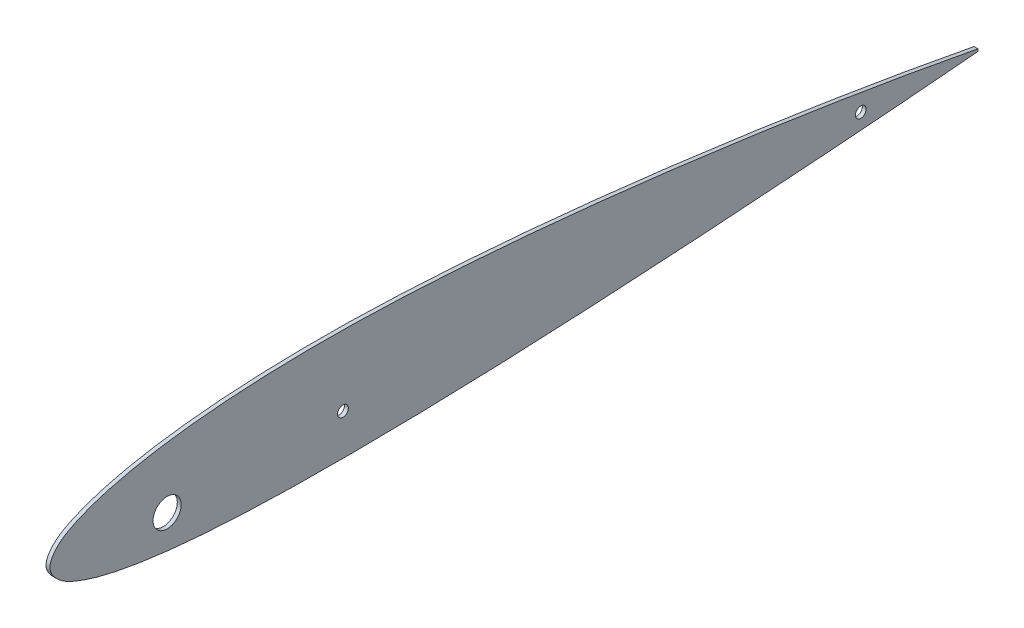
ISO-10303-21;
HEADER;
FILE_DESCRIPTION(('STEP AP214'),'2;1');
FILE_NAME('part.step','',(''),(''),'','','');
FILE_SCHEMA(('AUTOMOTIVE_DESIGN { 1 0 10303 214 1 1 1 1 }'));
ENDSEC;
DATA;
#1=APPLICATION_CONTEXT('core data for automotive mechanical design processes');
#2=APPLICATION_PROTOCOL_DEFINITION('international standard','automotive_design',2000,#1);
#3=PRODUCT_CONTEXT('',#1,'mechanical');
#4=PRODUCT('Part','Part','',(#3));
#5=PRODUCT_RELATED_PRODUCT_CATEGORY('part','',(#4));
#6=PRODUCT_DEFINITION_FORMATION('','',#4);
#7=PRODUCT_DEFINITION_CONTEXT('part definition',#1,'design');
#8=PRODUCT_DEFINITION('design','',#6,#7);
#9=PRODUCT_DEFINITION_SHAPE('','',#8);
#10=(LENGTH_UNIT() NAMED_UNIT(*) SI_UNIT(.MILLI.,.METRE.));
#11=(NAMED_UNIT(*) PLANE_ANGLE_UNIT() SI_UNIT($,.RADIAN.));
#12=(NAMED_UNIT(*) SI_UNIT($,.STERADIAN.) SOLID_ANGLE_UNIT());
#13=UNCERTAINTY_MEASURE_WITH_UNIT(LENGTH_MEASURE(1.E-05),#10,'distance_accuracy_value','');
#14=(GEOMETRIC_REPRESENTATION_CONTEXT(3) GLOBAL_UNCERTAINTY_ASSIGNED_CONTEXT((#13)) GLOBAL_UNIT_ASSIGNED_CONTEXT((#10,
#11,#12)) REPRESENTATION_CONTEXT('',''));
#15=CARTESIAN_POINT('',(0.,0.,0.));
#16=DIRECTION('',(0.,0.,1.));
#17=DIRECTION('',(1.,0.,0.));
#18=AXIS2_PLACEMENT_3D('',#15,#16,#17);
#19=CARTESIAN_POINT('',(2.,0.598497198061794,-475.010074802855));
#20=CARTESIAN_POINT('',(2.,2.0790236287189,-467.158690520784));
#21=CARTESIAN_POINT('',(2.,5.04046520752321,-451.453860547719));
#22=CARTESIAN_POINT('',(2.,10.5303729676981,-419.979582043477));
#23=CARTESIAN_POINT('',(2.,16.8373236789927,-380.568519358802));
#24=CARTESIAN_POINT('',(2.,23.5016640304857,-333.177066429499));
#25=CARTESIAN_POINT('',(2.,29.2721627629077,-285.712995661429));
#26=CARTESIAN_POINT('',(2.,33.9707482150302,-238.176447157113));
#27=CARTESIAN_POINT('',(2.,37.4185172913638,-190.512569895496));
#28=CARTESIAN_POINT('',(2.,38.771778218813,-150.679357097197));
#29=CARTESIAN_POINT('',(2.,38.4312492810106,-118.758979212691));
#30=CARTESIAN_POINT('',(2.,37.3917675533514,-94.8132002730884));
#31=CARTESIAN_POINT('',(2.,35.2890977949255,-70.8709465141157));
#32=CARTESIAN_POINT('',(2.,32.4441637644638,-50.9619868844845));
#33=CARTESIAN_POINT('',(2.,29.0608425273149,-35.093906393071));
#34=CARTESIAN_POINT('',(2.,25.7786131745384,-23.1483181376206));
#35=CARTESIAN_POINT('',(2.,21.7884828092321,-13.1031754093609));
#36=CARTESIAN_POINT('',(2.,17.0044592579488,-4.48816979284215));
#37=CARTESIAN_POINT('',(2.,7.90094705341297,2.91234120427389));
#38=CARTESIAN_POINT('',(2.,-0.676100888636408,-5.05216124977651));
#39=CARTESIAN_POINT('',(2.,-4.94658367346644,-13.8832659371882));
#40=CARTESIAN_POINT('',(2.,-8.35498448423368,-24.0571931578956));
#41=CARTESIAN_POINT('',(2.,-11.0298527935371,-36.04230965412));
#42=CARTESIAN_POINT('',(2.,-13.6976980033518,-51.8649255104538));
#43=CARTESIAN_POINT('',(2.,-15.8676272838065,-71.6006452179179));
#44=CARTESIAN_POINT('',(2.,-17.4191085566015,-95.2553331511756));
#45=CARTESIAN_POINT('',(2.,-18.2335362886324,-118.863099098869));
#46=CARTESIAN_POINT('',(2.,-18.6213010186528,-150.313877095147));
#47=CARTESIAN_POINT('',(2.,-18.1807835065514,-189.707327800163));
#48=CARTESIAN_POINT('',(2.,-16.6534864273974,-237.048964840664));
#49=CARTESIAN_POINT('',(2.,-14.3400470711003,-284.501569815214));
#50=CARTESIAN_POINT('',(2.,-11.493536730421,-332.013270591345));
#51=CARTESIAN_POINT('',(2.,-8.26585973787703,-379.598404528134));
#52=CARTESIAN_POINT('',(2.,-5.27824397196585,-419.295052652683));
#53=CARTESIAN_POINT('',(2.,-2.68922426390956,-451.101430605551));
#54=CARTESIAN_POINT('',(2.,-1.29597982699712,-467.020539675113));
#55=CARTESIAN_POINT('',(2.,-0.598497198061795,-474.989925197145));
#56=B_SPLINE_CURVE_WITH_KNOTS('',3,(#19,#20,#21,#22,#23,#24,#25,#26,#27,#28,#29,#30,#31,#32,#33,
#34,#35,#36,#37,#38,#39,#40,#41,#42,#43,#44,#45,#46,#47,#48,#49,#50,#51,#52,#53,#54,#55),
.UNSPECIFIED.,.F.,.F.,(4,1,1,1,1,1,1,1,1,1,1,1,1,1,1,1,1,1,1,1,1,1,1,1,1,1,1,1,1,1,1,1,1,1,4),
(0.,0.0247583527022921,0.0495232057983208,0.099002464419805,0.148431640988793,0.197816092678823,
0.247156978041538,0.296440500967814,0.345884085447012,0.370605915917013,0.395346156344423,
0.420138805885135,0.4450560288657,0.457622030352105,0.470360866612067,0.483523326653886,
0.490626325383128,0.501772115898221,0.512907946738326,0.519977099804335,0.533052484339323,
0.545674076898575,0.558115541146016,0.58272509680566,0.607174358189599,0.631557278595084,
0.65591625667648,0.704636043070596,0.753621853029336,0.80268738739157,0.851851697592658,
0.901113053173649,0.950481472331415,0.975210155559022,1.),.UNSPECIFIED.);
#57=DIRECTION('',(-1.,0.,0.));
#58=VECTOR('',#57,1.);
#59=SURFACE_OF_LINEAR_EXTRUSION('',#56,#58);
#60=CARTESIAN_POINT('',(0.,0.598497198061794,-475.010074802855));
#61=CARTESIAN_POINT('',(0.,2.0790236287189,-467.158690520784));
#62=CARTESIAN_POINT('',(0.,5.04046520752321,-451.453860547719));
#63=CARTESIAN_POINT('',(0.,10.5303729676981,-419.979582043477));
#64=CARTESIAN_POINT('',(0.,16.8373236789927,-380.568519358802));
#65=CARTESIAN_POINT('',(0.,23.5016640304857,-333.177066429499));
#66=CARTESIAN_POINT('',(0.,29.2721627629077,-285.712995661429));
#67=CARTESIAN_POINT('',(0.,33.9707482150302,-238.176447157113));
#68=CARTESIAN_POINT('',(0.,37.4185172913638,-190.512569895496));
#69=CARTESIAN_POINT('',(0.,38.771778218813,-150.679357097197));
#70=CARTESIAN_POINT('',(0.,38.4312492810106,-118.758979212691));
#71=CARTESIAN_POINT('',(0.,37.3917675533514,-94.8132002730884));
#72=CARTESIAN_POINT('',(0.,35.2890977949255,-70.8709465141157));
#73=CARTESIAN_POINT('',(0.,32.4441637644638,-50.9619868844845));
#74=CARTESIAN_POINT('',(0.,29.0608425273149,-35.093906393071));
#75=CARTESIAN_POINT('',(0.,25.7786131745384,-23.1483181376206));
#76=CARTESIAN_POINT('',(0.,21.7884828092321,-13.1031754093609));
#77=CARTESIAN_POINT('',(0.,17.0044592579488,-4.48816979284215));
#78=CARTESIAN_POINT('',(0.,7.90094705341297,2.91234120427389));
#79=CARTESIAN_POINT('',(0.,-0.676100888636408,-5.05216124977651));
#80=CARTESIAN_POINT('',(0.,-4.94658367346644,-13.8832659371882));
#81=CARTESIAN_POINT('',(0.,-8.35498448423368,-24.0571931578956));
#82=CARTESIAN_POINT('',(0.,-11.0298527935371,-36.04230965412));
#83=CARTESIAN_POINT('',(0.,-13.6976980033518,-51.8649255104538));
#84=CARTESIAN_POINT('',(0.,-15.8676272838065,-71.6006452179179));
#85=CARTESIAN_POINT('',(0.,-17.4191085566015,-95.2553331511756));
#86=CARTESIAN_POINT('',(0.,-18.2335362886324,-118.863099098869));
#87=CARTESIAN_POINT('',(0.,-18.6213010186528,-150.313877095147));
#88=CARTESIAN_POINT('',(0.,-18.1807835065514,-189.707327800163));
#89=CARTESIAN_POINT('',(0.,-16.6534864273974,-237.048964840664));
#90=CARTESIAN_POINT('',(0.,-14.3400470711003,-284.501569815214));
#91=CARTESIAN_POINT('',(0.,-11.493536730421,-332.013270591345));
#92=CARTESIAN_POINT('',(0.,-8.26585973787703,-379.598404528134));
#93=CARTESIAN_POINT('',(0.,-5.27824397196585,-419.295052652683));
#94=CARTESIAN_POINT('',(0.,-2.68922426390956,-451.101430605551));
#95=CARTESIAN_POINT('',(0.,-1.29597982699712,-467.020539675113));
#96=CARTESIAN_POINT('',(0.,-0.598497198061795,-474.989925197145));
#97=B_SPLINE_CURVE_WITH_KNOTS('',3,(#60,#61,#62,#63,#64,#65,#66,#67,#68,#69,#70,#71,#72,#73,#74,
#75,#76,#77,#78,#79,#80,#81,#82,#83,#84,#85,#86,#87,#88,#89,#90,#91,#92,#93,#94,#95,#96),
.UNSPECIFIED.,.F.,.F.,(4,1,1,1,1,1,1,1,1,1,1,1,1,1,1,1,1,1,1,1,1,1,1,1,1,1,1,1,1,1,1,1,1,1,4),
(0.,0.0247583527022921,0.0495232057983208,0.099002464419805,0.148431640988793,0.197816092678823,
0.247156978041538,0.296440500967814,0.345884085447012,0.370605915917013,0.395346156344423,
0.420138805885135,0.4450560288657,0.457622030352105,0.470360866612067,0.483523326653886,
0.490626325383128,0.501772115898221,0.512907946738326,0.519977099804335,0.533052484339323,
0.545674076898575,0.558115541146016,0.58272509680566,0.607174358189599,0.631557278595084,
0.65591625667648,0.704636043070596,0.753621853029336,0.80268738739157,0.851851697592658,
0.901113053173649,0.950481472331415,0.975210155559022,1.),.UNSPECIFIED.);
#98=CARTESIAN_POINT('',(0.,0.598497198061795,-475.010074802855));
#99=VERTEX_POINT('',#98);
#100=CARTESIAN_POINT('',(0.,-0.598497198061795,-474.989925197145));
#101=VERTEX_POINT('',#100);
#102=EDGE_CURVE('E69',#99,#101,#97,.T.);
#103=ORIENTED_EDGE('',*,*,#102,.T.);
#104=DIRECTION('',(-1.,0.,0.));
#105=VECTOR('',#104,1.);
#106=CARTESIAN_POINT('',(2.,-0.598497198061795,-474.989925197145));
#107=LINE('',#106,#105);
#108=CARTESIAN_POINT('',(2.,-0.598497198061795,-474.989925197145));
#109=VERTEX_POINT('',#108);
#110=EDGE_CURVE('E11',#109,#101,#107,.T.);
#111=ORIENTED_EDGE('',*,*,#110,.F.);
#112=CARTESIAN_POINT('',(2.,0.598497198061795,-475.010074802855));
#113=VERTEX_POINT('',#112);
#114=EDGE_CURVE('E68',#113,#109,#56,.T.);
#115=ORIENTED_EDGE('',*,*,#114,.F.);
#116=DIRECTION('',(-1.,0.,0.));
#117=VECTOR('',#116,1.);
#118=CARTESIAN_POINT('',(2.,0.598497198061795,-475.010074802855));
#119=LINE('',#118,#117);
#120=EDGE_CURVE('E45',#113,#99,#119,.T.);
#121=ORIENTED_EDGE('',*,*,#120,.T.);
#122=EDGE_LOOP('',(#103,#111,#115,#121));
#123=FACE_BOUND('',#122,.T.);
#124=ADVANCED_FACE('F35',(#123),#59,.F.);
#125=CARTESIAN_POINT('',(2.,0.598497198061795,-475.010074802855));
#126=DIRECTION('',(0.,0.0168311159332721,0.999858346735397));
#127=DIRECTION('',(0.,-0.999858346735397,0.0168311159332722));
#128=AXIS2_PLACEMENT_3D('',#125,#126,#127);
#129=PLANE('',#128);
#130=DIRECTION('',(0.,0.999858346735397,-0.0168311159332722));
#131=VECTOR('',#130,1.);
#132=CARTESIAN_POINT('',(0.,0.598497198061795,-475.010074802855));
#133=LINE('',#132,#131);
#134=EDGE_CURVE('E61',#101,#99,#133,.T.);
#135=ORIENTED_EDGE('',*,*,#134,.T.);
#136=ORIENTED_EDGE('',*,*,#120,.F.);
#137=DIRECTION('',(0.,0.999858346735397,-0.0168311159332722));
#138=VECTOR('',#137,1.);
#139=CARTESIAN_POINT('',(2.,0.598497198061795,-475.010074802855));
#140=LINE('',#139,#138);
#141=EDGE_CURVE('E53',#109,#113,#140,.T.);
#142=ORIENTED_EDGE('',*,*,#141,.F.);
#143=ORIENTED_EDGE('',*,*,#110,.T.);
#144=EDGE_LOOP('',(#135,#136,#142,#143));
#145=FACE_BOUND('',#144,.T.);
#146=ADVANCED_FACE('F64',(#145),#129,.F.);
#147=CARTESIAN_POINT('',(2.,9.59888707137419,-0.159864127170061));
#148=DIRECTION('',(-1.,0.,0.));
#149=DIRECTION('',(0.,0.,1.));
#150=AXIS2_PLACEMENT_3D('',#147,#148,#149);
#151=PLANE('',#150);
#152=CARTESIAN_POINT('',(2.,2.5000018824215,-60.));
#153=DIRECTION('',(1.,0.,0.));
#154=DIRECTION('',(0.,0.,-1.));
#155=AXIS2_PLACEMENT_3D('',#152,#153,#154);
#156=CIRCLE('',#155,7.19536101);
#157=CARTESIAN_POINT('',(2.,2.5000018824215,-67.19536101));
#158=VERTEX_POINT('',#157);
#159=EDGE_CURVE('E86',#158,#158,#156,.T.);
#160=ORIENTED_EDGE('',*,*,#159,.F.);
#161=EDGE_LOOP('',(#160));
#162=FACE_BOUND('',#161,.T.);
#163=CARTESIAN_POINT('',(2.,2.5000018824215,-150.));
#164=DIRECTION('',(1.,0.,0.));
#165=DIRECTION('',(0.,0.,-1.));
#166=AXIS2_PLACEMENT_3D('',#163,#164,#165);
#167=CIRCLE('',#166,2.75000000000001);
#168=CARTESIAN_POINT('',(2.,2.5000018824215,-152.75));
#169=VERTEX_POINT('',#168);
#170=EDGE_CURVE('E108',#169,#169,#167,.T.);
#171=ORIENTED_EDGE('',*,*,#170,.F.);
#172=EDGE_LOOP('',(#171));
#173=FACE_BOUND('',#172,.T.);
#174=CARTESIAN_POINT('',(2.,2.50000188242148,-415.033583382836));
#175=DIRECTION('',(1.,0.,0.));
#176=DIRECTION('',(0.,0.,-1.));
#177=AXIS2_PLACEMENT_3D('',#174,#175,#176);
#178=CIRCLE('',#177,2.75000000000004);
#179=CARTESIAN_POINT('',(2.,2.50000188242148,-417.783583382836));
#180=VERTEX_POINT('',#179);
#181=EDGE_CURVE('E106',#180,#180,#178,.T.);
#182=ORIENTED_EDGE('',*,*,#181,.F.);
#183=EDGE_LOOP('',(#182));
#184=FACE_BOUND('',#183,.T.);
#185=ORIENTED_EDGE('',*,*,#114,.T.);
#186=ORIENTED_EDGE('',*,*,#141,.T.);
#187=EDGE_LOOP('',(#185,#186));
#188=FACE_BOUND('',#187,.T.);
#189=ADVANCED_FACE('F96',(#162,#173,#184,#188),#151,.F.);
#190=CARTESIAN_POINT('',(0.,9.59888707137419,-0.159864127170061));
#191=DIRECTION('',(-1.,0.,0.));
#192=DIRECTION('',(0.,0.,1.));
#193=AXIS2_PLACEMENT_3D('',#190,#191,#192);
#194=PLANE('',#193);
#195=CARTESIAN_POINT('',(0.,2.5000018824215,-60.));
#196=DIRECTION('',(-1.,0.,0.));
#197=DIRECTION('',(0.,0.,1.));
#198=AXIS2_PLACEMENT_3D('',#195,#196,#197);
#199=CIRCLE('',#198,7.19536101);
#200=CARTESIAN_POINT('',(0.,2.5000018824215,-52.80463899));
#201=VERTEX_POINT('',#200);
#202=EDGE_CURVE('E39',#201,#201,#199,.T.);
#203=ORIENTED_EDGE('',*,*,#202,.F.);
#204=EDGE_LOOP('',(#203));
#205=FACE_BOUND('',#204,.T.);
#206=CARTESIAN_POINT('',(0.,2.5000018824215,-150.));
#207=DIRECTION('',(-1.,0.,0.));
#208=DIRECTION('',(0.,0.,1.));
#209=AXIS2_PLACEMENT_3D('',#206,#207,#208);
#210=CIRCLE('',#209,2.75000000000001);
#211=CARTESIAN_POINT('',(0.,2.5000018824215,-147.25));
#212=VERTEX_POINT('',#211);
#213=EDGE_CURVE('E76',#212,#212,#210,.T.);
#214=ORIENTED_EDGE('',*,*,#213,.F.);
#215=EDGE_LOOP('',(#214));
#216=FACE_BOUND('',#215,.T.);
#217=CARTESIAN_POINT('',(0.,2.50000188242148,-415.033583382836));
#218=DIRECTION('',(-1.,0.,0.));
#219=DIRECTION('',(0.,0.,1.));
#220=AXIS2_PLACEMENT_3D('',#217,#218,#219);
#221=CIRCLE('',#220,2.75000000000004);
#222=CARTESIAN_POINT('',(0.,2.50000188242148,-412.283583382836));
#223=VERTEX_POINT('',#222);
#224=EDGE_CURVE('E84',#223,#223,#221,.T.);
#225=ORIENTED_EDGE('',*,*,#224,.F.);
#226=EDGE_LOOP('',(#225));
#227=FACE_BOUND('',#226,.T.);
#228=ORIENTED_EDGE('',*,*,#102,.F.);
#229=ORIENTED_EDGE('',*,*,#134,.F.);
#230=EDGE_LOOP('',(#228,#229));
#231=FACE_BOUND('',#230,.T.);
#232=ADVANCED_FACE('F73',(#205,#216,#227,#231),#194,.T.);
#233=CARTESIAN_POINT('',(-1.2E-05,2.50000188242148,-415.033583382836));
#234=DIRECTION('',(1.,0.,0.));
#235=DIRECTION('',(0.,0.,-1.));
#236=AXIS2_PLACEMENT_3D('',#233,#234,#235);
#237=CYLINDRICAL_SURFACE('',#236,2.75000000000004);
#238=ORIENTED_EDGE('',*,*,#224,.T.);
#239=EDGE_LOOP('',(#238));
#240=FACE_BOUND('',#239,.T.);
#241=ORIENTED_EDGE('',*,*,#181,.T.);
#242=EDGE_LOOP('',(#241));
#243=FACE_BOUND('',#242,.T.);
#244=ADVANCED_FACE('F95',(#240,#243),#237,.F.);
#245=CARTESIAN_POINT('',(-1.2E-05,2.5000018824215,-150.));
#246=DIRECTION('',(1.,0.,0.));
#247=DIRECTION('',(0.,0.,-1.));
#248=AXIS2_PLACEMENT_3D('',#245,#246,#247);
#249=CYLINDRICAL_SURFACE('',#248,2.75000000000001);
#250=ORIENTED_EDGE('',*,*,#213,.T.);
#251=EDGE_LOOP('',(#250));
#252=FACE_BOUND('',#251,.T.);
#253=ORIENTED_EDGE('',*,*,#170,.T.);
#254=EDGE_LOOP('',(#253));
#255=FACE_BOUND('',#254,.T.);
#256=ADVANCED_FACE('F90',(#252,#255),#249,.F.);
#257=CARTESIAN_POINT('',(-1.2E-05,2.5000018824215,-60.));
#258=DIRECTION('',(1.,0.,0.));
#259=DIRECTION('',(0.,0.,-1.));
#260=AXIS2_PLACEMENT_3D('',#257,#258,#259);
#261=CYLINDRICAL_SURFACE('',#260,7.19536101);
#262=ORIENTED_EDGE('',*,*,#202,.T.);
#263=EDGE_LOOP('',(#262));
#264=FACE_BOUND('',#263,.T.);
#265=ORIENTED_EDGE('',*,*,#159,.T.);
#266=EDGE_LOOP('',(#265));
#267=FACE_BOUND('',#266,.T.);
#268=ADVANCED_FACE('F159',(#264,#267),#261,.F.);
#269=CLOSED_SHELL('',(#124,#146,#189,#232,#244,#256,#268));
#270=MANIFOLD_SOLID_BREP('B2',#269);
#271=ADVANCED_BREP_SHAPE_REPRESENTATION('',(#18,#270),#14);
#272=SHAPE_DEFINITION_REPRESENTATION(#9,#271);
ENDSEC;
END-ISO-10303-21;
